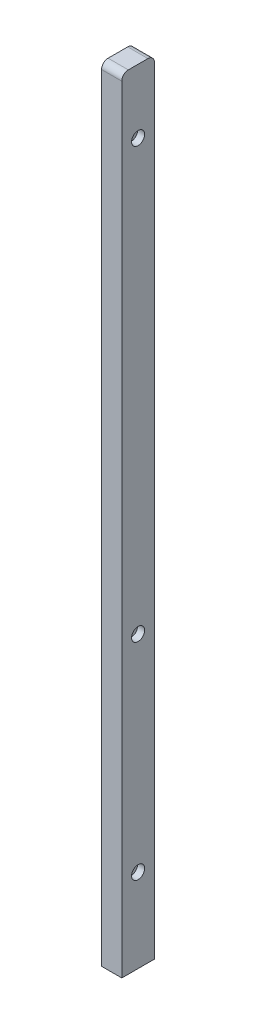
ISO-10303-21;
HEADER;
FILE_DESCRIPTION(('STEP AP214'),'2;1');
FILE_NAME('part.step','',(''),(''),'','','');
FILE_SCHEMA(('AUTOMOTIVE_DESIGN { 1 0 10303 214 1 1 1 1 }'));
ENDSEC;
DATA;
#1=APPLICATION_CONTEXT('core data for automotive mechanical design processes');
#2=APPLICATION_PROTOCOL_DEFINITION('international standard','automotive_design',2000,#1);
#3=PRODUCT_CONTEXT('',#1,'mechanical');
#4=PRODUCT('Part','Part','',(#3));
#5=PRODUCT_RELATED_PRODUCT_CATEGORY('part','',(#4));
#6=PRODUCT_DEFINITION_FORMATION('','',#4);
#7=PRODUCT_DEFINITION_CONTEXT('part definition',#1,'design');
#8=PRODUCT_DEFINITION('design','',#6,#7);
#9=PRODUCT_DEFINITION_SHAPE('','',#8);
#10=(LENGTH_UNIT() NAMED_UNIT(*) SI_UNIT(.MILLI.,.METRE.));
#11=(NAMED_UNIT(*) PLANE_ANGLE_UNIT() SI_UNIT($,.RADIAN.));
#12=(NAMED_UNIT(*) SI_UNIT($,.STERADIAN.) SOLID_ANGLE_UNIT());
#13=UNCERTAINTY_MEASURE_WITH_UNIT(LENGTH_MEASURE(1.E-05),#10,'distance_accuracy_value','');
#14=(GEOMETRIC_REPRESENTATION_CONTEXT(3) GLOBAL_UNCERTAINTY_ASSIGNED_CONTEXT((#13)) GLOBAL_UNIT_ASSIGNED_CONTEXT((#10,
#11,#12)) REPRESENTATION_CONTEXT('',''));
#15=CARTESIAN_POINT('',(0.,0.,0.));
#16=DIRECTION('',(0.,0.,1.));
#17=DIRECTION('',(1.,0.,0.));
#18=AXIS2_PLACEMENT_3D('',#15,#16,#17);
#19=CARTESIAN_POINT('',(7.75,600.,12.5));
#20=DIRECTION('',(-1.,0.,0.));
#21=DIRECTION('',(0.,0.,1.));
#22=AXIS2_PLACEMENT_3D('',#19,#20,#21);
#23=PLANE('',#22);
#24=CARTESIAN_POINT('',(7.75,222.,0.));
#25=DIRECTION('',(1.,0.,0.));
#26=DIRECTION('',(0.,0.,-1.));
#27=AXIS2_PLACEMENT_3D('',#24,#25,#26);
#28=CIRCLE('',#27,5.);
#29=CARTESIAN_POINT('',(7.75,222.,-5.));
#30=VERTEX_POINT('',#29);
#31=EDGE_CURVE('E267',#30,#30,#28,.T.);
#32=ORIENTED_EDGE('',*,*,#31,.F.);
#33=EDGE_LOOP('',(#32));
#34=FACE_BOUND('',#33,.T.);
#35=CARTESIAN_POINT('',(7.75,551.,0.));
#36=DIRECTION('',(1.,0.,0.));
#37=DIRECTION('',(0.,0.,-1.));
#38=AXIS2_PLACEMENT_3D('',#35,#36,#37);
#39=CIRCLE('',#38,5.);
#40=CARTESIAN_POINT('',(7.75,551.,-5.));
#41=VERTEX_POINT('',#40);
#42=EDGE_CURVE('E281',#41,#41,#39,.T.);
#43=ORIENTED_EDGE('',*,*,#42,.F.);
#44=EDGE_LOOP('',(#43));
#45=FACE_BOUND('',#44,.T.);
#46=CARTESIAN_POINT('',(7.75,64.,0.));
#47=DIRECTION('',(1.,0.,0.));
#48=DIRECTION('',(0.,0.,-1.));
#49=AXIS2_PLACEMENT_3D('',#46,#47,#48);
#50=CIRCLE('',#49,5.);
#51=CARTESIAN_POINT('',(7.75,64.,-5.));
#52=VERTEX_POINT('',#51);
#53=EDGE_CURVE('E297',#52,#52,#50,.T.);
#54=ORIENTED_EDGE('',*,*,#53,.F.);
#55=EDGE_LOOP('',(#54));
#56=FACE_BOUND('',#55,.T.);
#57=DIRECTION('',(0.,-1.,0.));
#58=VECTOR('',#57,1.);
#59=CARTESIAN_POINT('',(7.75,600.,-12.5));
#60=LINE('',#59,#58);
#61=CARTESIAN_POINT('',(7.75,595.,-12.5));
#62=VERTEX_POINT('',#61);
#63=CARTESIAN_POINT('',(7.75,0.,-12.5));
#64=VERTEX_POINT('',#63);
#65=EDGE_CURVE('E150',#62,#64,#60,.T.);
#66=ORIENTED_EDGE('',*,*,#65,.F.);
#67=CARTESIAN_POINT('',(7.75,595.,-7.5));
#68=DIRECTION('',(-1.,0.,0.));
#69=DIRECTION('',(0.,0.,1.));
#70=AXIS2_PLACEMENT_3D('',#67,#68,#69);
#71=CIRCLE('',#70,5.);
#72=CARTESIAN_POINT('',(7.75,600.,-7.5));
#73=VERTEX_POINT('',#72);
#74=EDGE_CURVE('E53',#62,#73,#71,.F.);
#75=ORIENTED_EDGE('',*,*,#74,.T.);
#76=DIRECTION('',(0.,0.,-1.));
#77=VECTOR('',#76,1.);
#78=CARTESIAN_POINT('',(7.75,600.,12.5));
#79=LINE('',#78,#77);
#80=CARTESIAN_POINT('',(7.75,600.,7.5));
#81=VERTEX_POINT('',#80);
#82=EDGE_CURVE('E122',#81,#73,#79,.T.);
#83=ORIENTED_EDGE('',*,*,#82,.F.);
#84=CARTESIAN_POINT('',(7.75,595.,7.5));
#85=DIRECTION('',(-1.,0.,0.));
#86=DIRECTION('',(0.,0.,1.));
#87=AXIS2_PLACEMENT_3D('',#84,#85,#86);
#88=CIRCLE('',#87,5.);
#89=CARTESIAN_POINT('',(7.75,595.,12.5));
#90=VERTEX_POINT('',#89);
#91=EDGE_CURVE('E60',#81,#90,#88,.F.);
#92=ORIENTED_EDGE('',*,*,#91,.T.);
#93=DIRECTION('',(0.,-1.,0.));
#94=VECTOR('',#93,1.);
#95=CARTESIAN_POINT('',(7.75,600.,12.5));
#96=LINE('',#95,#94);
#97=CARTESIAN_POINT('',(7.75,0.,12.5));
#98=VERTEX_POINT('',#97);
#99=EDGE_CURVE('E130',#90,#98,#96,.T.);
#100=ORIENTED_EDGE('',*,*,#99,.T.);
#101=DIRECTION('',(0.,0.,-1.));
#102=VECTOR('',#101,1.);
#103=CARTESIAN_POINT('',(7.75,0.,12.5));
#104=LINE('',#103,#102);
#105=EDGE_CURVE('E109',#98,#64,#104,.T.);
#106=ORIENTED_EDGE('',*,*,#105,.T.);
#107=EDGE_LOOP('',(#66,#75,#83,#92,#100,#106));
#108=FACE_BOUND('',#107,.T.);
#109=ADVANCED_FACE('F44',(#34,#45,#56,#108),#23,.F.);
#110=CARTESIAN_POINT('',(-7.75,600.,-12.5));
#111=DIRECTION('',(0.,0.,1.));
#112=DIRECTION('',(1.,0.,0.));
#113=AXIS2_PLACEMENT_3D('',#110,#111,#112);
#114=PLANE('',#113);
#115=DIRECTION('',(0.,-1.,0.));
#116=VECTOR('',#115,1.);
#117=CARTESIAN_POINT('',(-7.75,600.,-12.5));
#118=LINE('',#117,#116);
#119=CARTESIAN_POINT('',(-7.75,595.,-12.5));
#120=VERTEX_POINT('',#119);
#121=CARTESIAN_POINT('',(-7.75,0.,-12.5));
#122=VERTEX_POINT('',#121);
#123=EDGE_CURVE('E147',#120,#122,#118,.T.);
#124=ORIENTED_EDGE('',*,*,#123,.F.);
#125=DIRECTION('',(-1.,0.,0.));
#126=VECTOR('',#125,1.);
#127=CARTESIAN_POINT('',(-7.75,595.,-12.5));
#128=LINE('',#127,#126);
#129=EDGE_CURVE('E68',#120,#62,#128,.F.);
#130=ORIENTED_EDGE('',*,*,#129,.T.);
#131=ORIENTED_EDGE('',*,*,#65,.T.);
#132=DIRECTION('',(-1.,0.,0.));
#133=VECTOR('',#132,1.);
#134=CARTESIAN_POINT('',(-7.75,0.,-12.5));
#135=LINE('',#134,#133);
#136=EDGE_CURVE('E115',#64,#122,#135,.T.);
#137=ORIENTED_EDGE('',*,*,#136,.T.);
#138=EDGE_LOOP('',(#124,#130,#131,#137));
#139=FACE_BOUND('',#138,.T.);
#140=ADVANCED_FACE('F181',(#139),#114,.F.);
#141=CARTESIAN_POINT('',(-7.75,600.,12.5));
#142=DIRECTION('',(1.,0.,0.));
#143=DIRECTION('',(0.,0.,-1.));
#144=AXIS2_PLACEMENT_3D('',#141,#142,#143);
#145=PLANE('',#144);
#146=CARTESIAN_POINT('',(-7.75,222.,0.));
#147=DIRECTION('',(1.,0.,0.));
#148=DIRECTION('',(0.,0.,-1.));
#149=AXIS2_PLACEMENT_3D('',#146,#147,#148);
#150=CIRCLE('',#149,2.75);
#151=CARTESIAN_POINT('',(-7.75,222.,-2.75));
#152=VERTEX_POINT('',#151);
#153=EDGE_CURVE('E277',#152,#152,#150,.T.);
#154=ORIENTED_EDGE('',*,*,#153,.T.);
#155=EDGE_LOOP('',(#154));
#156=FACE_BOUND('',#155,.T.);
#157=CARTESIAN_POINT('',(-7.75,551.,0.));
#158=DIRECTION('',(1.,0.,0.));
#159=DIRECTION('',(0.,0.,-1.));
#160=AXIS2_PLACEMENT_3D('',#157,#158,#159);
#161=CIRCLE('',#160,2.75000000000003);
#162=CARTESIAN_POINT('',(-7.75,551.,-2.75000000000003));
#163=VERTEX_POINT('',#162);
#164=EDGE_CURVE('E293',#163,#163,#161,.T.);
#165=ORIENTED_EDGE('',*,*,#164,.T.);
#166=EDGE_LOOP('',(#165));
#167=FACE_BOUND('',#166,.T.);
#168=CARTESIAN_POINT('',(-7.75,64.,0.));
#169=DIRECTION('',(1.,0.,0.));
#170=DIRECTION('',(0.,0.,-1.));
#171=AXIS2_PLACEMENT_3D('',#168,#169,#170);
#172=CIRCLE('',#171,2.75);
#173=CARTESIAN_POINT('',(-7.75,64.,-2.75));
#174=VERTEX_POINT('',#173);
#175=EDGE_CURVE('E118',#174,#174,#172,.T.);
#176=ORIENTED_EDGE('',*,*,#175,.T.);
#177=EDGE_LOOP('',(#176));
#178=FACE_BOUND('',#177,.T.);
#179=DIRECTION('',(0.,0.,1.));
#180=VECTOR('',#179,1.);
#181=CARTESIAN_POINT('',(-7.75,600.,12.5));
#182=LINE('',#181,#180);
#183=CARTESIAN_POINT('',(-7.75,600.,-7.5));
#184=VERTEX_POINT('',#183);
#185=CARTESIAN_POINT('',(-7.75,600.,7.5));
#186=VERTEX_POINT('',#185);
#187=EDGE_CURVE('E126',#184,#186,#182,.T.);
#188=ORIENTED_EDGE('',*,*,#187,.F.);
#189=CARTESIAN_POINT('',(-7.75,595.,-7.5));
#190=DIRECTION('',(1.,0.,0.));
#191=DIRECTION('',(0.,0.,-1.));
#192=AXIS2_PLACEMENT_3D('',#189,#190,#191);
#193=CIRCLE('',#192,5.);
#194=EDGE_CURVE('E164',#184,#120,#193,.F.);
#195=ORIENTED_EDGE('',*,*,#194,.T.);
#196=ORIENTED_EDGE('',*,*,#123,.T.);
#197=DIRECTION('',(0.,0.,1.));
#198=VECTOR('',#197,1.);
#199=CARTESIAN_POINT('',(-7.75,0.,12.5));
#200=LINE('',#199,#198);
#201=CARTESIAN_POINT('',(-7.75,0.,12.5));
#202=VERTEX_POINT('',#201);
#203=EDGE_CURVE('E135',#122,#202,#200,.T.);
#204=ORIENTED_EDGE('',*,*,#203,.T.);
#205=DIRECTION('',(0.,-1.,0.));
#206=VECTOR('',#205,1.);
#207=CARTESIAN_POINT('',(-7.75,600.,12.5));
#208=LINE('',#207,#206);
#209=CARTESIAN_POINT('',(-7.75,595.,12.5));
#210=VERTEX_POINT('',#209);
#211=EDGE_CURVE('E144',#210,#202,#208,.T.);
#212=ORIENTED_EDGE('',*,*,#211,.F.);
#213=CARTESIAN_POINT('',(-7.75,595.,7.5));
#214=DIRECTION('',(1.,0.,0.));
#215=DIRECTION('',(0.,0.,-1.));
#216=AXIS2_PLACEMENT_3D('',#213,#214,#215);
#217=CIRCLE('',#216,5.);
#218=EDGE_CURVE('E161',#210,#186,#217,.F.);
#219=ORIENTED_EDGE('',*,*,#218,.T.);
#220=EDGE_LOOP('',(#188,#195,#196,#204,#212,#219));
#221=FACE_BOUND('',#220,.T.);
#222=ADVANCED_FACE('F180',(#156,#167,#178,#221),#145,.F.);
#223=CARTESIAN_POINT('',(-7.75,600.,12.5));
#224=DIRECTION('',(0.,0.,-1.));
#225=DIRECTION('',(-1.,0.,0.));
#226=AXIS2_PLACEMENT_3D('',#223,#224,#225);
#227=PLANE('',#226);
#228=ORIENTED_EDGE('',*,*,#99,.F.);
#229=DIRECTION('',(1.,0.,0.));
#230=VECTOR('',#229,1.);
#231=CARTESIAN_POINT('',(-7.75,595.,12.5));
#232=LINE('',#231,#230);
#233=EDGE_CURVE('E11',#90,#210,#232,.F.);
#234=ORIENTED_EDGE('',*,*,#233,.T.);
#235=ORIENTED_EDGE('',*,*,#211,.T.);
#236=DIRECTION('',(1.,0.,0.));
#237=VECTOR('',#236,1.);
#238=CARTESIAN_POINT('',(-7.75,0.,12.5));
#239=LINE('',#238,#237);
#240=EDGE_CURVE('E127',#202,#98,#239,.T.);
#241=ORIENTED_EDGE('',*,*,#240,.T.);
#242=EDGE_LOOP('',(#228,#234,#235,#241));
#243=FACE_BOUND('',#242,.T.);
#244=ADVANCED_FACE('F193',(#243),#227,.F.);
#245=CARTESIAN_POINT('',(0.,600.,0.));
#246=DIRECTION('',(0.,-1.,0.));
#247=DIRECTION('',(0.,0.,-1.));
#248=AXIS2_PLACEMENT_3D('',#245,#246,#247);
#249=PLANE('',#248);
#250=ORIENTED_EDGE('',*,*,#82,.T.);
#251=DIRECTION('',(-1.,0.,0.));
#252=VECTOR('',#251,1.);
#253=CARTESIAN_POINT('',(0.,600.,-7.5));
#254=LINE('',#253,#252);
#255=EDGE_CURVE('E157',#73,#184,#254,.T.);
#256=ORIENTED_EDGE('',*,*,#255,.T.);
#257=ORIENTED_EDGE('',*,*,#187,.T.);
#258=DIRECTION('',(1.,0.,0.));
#259=VECTOR('',#258,1.);
#260=CARTESIAN_POINT('',(0.,600.,7.5));
#261=LINE('',#260,#259);
#262=EDGE_CURVE('E153',#186,#81,#261,.T.);
#263=ORIENTED_EDGE('',*,*,#262,.T.);
#264=EDGE_LOOP('',(#250,#256,#257,#263));
#265=FACE_BOUND('',#264,.T.);
#266=ADVANCED_FACE('F175',(#265),#249,.F.);
#267=CARTESIAN_POINT('',(0.,0.,0.));
#268=DIRECTION('',(0.,-1.,0.));
#269=DIRECTION('',(0.,0.,-1.));
#270=AXIS2_PLACEMENT_3D('',#267,#268,#269);
#271=PLANE('',#270);
#272=CARTESIAN_POINT('',(0.,0.,0.));
#273=DIRECTION('',(0.,-1.,0.));
#274=DIRECTION('',(0.,0.,-1.));
#275=AXIS2_PLACEMENT_3D('',#272,#273,#274);
#276=CIRCLE('',#275,3.3);
#277=CARTESIAN_POINT('',(0.,0.,-3.3));
#278=VERTEX_POINT('',#277);
#279=EDGE_CURVE('E110',#278,#278,#276,.T.);
#280=ORIENTED_EDGE('',*,*,#279,.F.);
#281=EDGE_LOOP('',(#280));
#282=FACE_BOUND('',#281,.T.);
#283=ORIENTED_EDGE('',*,*,#105,.F.);
#284=ORIENTED_EDGE('',*,*,#240,.F.);
#285=ORIENTED_EDGE('',*,*,#203,.F.);
#286=ORIENTED_EDGE('',*,*,#136,.F.);
#287=EDGE_LOOP('',(#283,#284,#285,#286));
#288=FACE_BOUND('',#287,.T.);
#289=ADVANCED_FACE('F187',(#282,#288),#271,.T.);
#290=CARTESIAN_POINT('',(0.,595.,-7.5));
#291=DIRECTION('',(-1.,0.,0.));
#292=DIRECTION('',(0.,0.,1.));
#293=AXIS2_PLACEMENT_3D('',#290,#291,#292);
#294=CYLINDRICAL_SURFACE('',#293,5.);
#295=ORIENTED_EDGE('',*,*,#74,.F.);
#296=ORIENTED_EDGE('',*,*,#129,.F.);
#297=ORIENTED_EDGE('',*,*,#194,.F.);
#298=ORIENTED_EDGE('',*,*,#255,.F.);
#299=EDGE_LOOP('',(#295,#296,#297,#298));
#300=FACE_BOUND('',#299,.T.);
#301=ADVANCED_FACE('F178',(#300),#294,.T.);
#302=CARTESIAN_POINT('',(0.,595.,7.5));
#303=DIRECTION('',(1.,0.,0.));
#304=DIRECTION('',(0.,0.,-1.));
#305=AXIS2_PLACEMENT_3D('',#302,#303,#304);
#306=CYLINDRICAL_SURFACE('',#305,5.);
#307=ORIENTED_EDGE('',*,*,#218,.F.);
#308=ORIENTED_EDGE('',*,*,#233,.F.);
#309=ORIENTED_EDGE('',*,*,#91,.F.);
#310=ORIENTED_EDGE('',*,*,#262,.F.);
#311=EDGE_LOOP('',(#307,#308,#309,#310));
#312=FACE_BOUND('',#311,.T.);
#313=ADVANCED_FACE('F46',(#312),#306,.T.);
#314=CARTESIAN_POINT('',(0.,12.,0.));
#315=DIRECTION('',(0.,-1.,0.));
#316=DIRECTION('',(0.,0.,-1.));
#317=AXIS2_PLACEMENT_3D('',#314,#315,#316);
#318=CONICAL_SURFACE('',#317,3.3,1.02974425867665);
#319=CARTESIAN_POINT('',(0.,13.9828400427909,0.));
#320=VERTEX_POINT('',#319);
#321=VERTEX_LOOP('',#320);
#322=FACE_BOUND('',#321,.T.);
#323=CARTESIAN_POINT('',(0.,12.,0.));
#324=DIRECTION('',(0.,-1.,0.));
#325=DIRECTION('',(0.,0.,-1.));
#326=AXIS2_PLACEMENT_3D('',#323,#324,#325);
#327=CIRCLE('',#326,3.3);
#328=CARTESIAN_POINT('',(0.,12.,-3.3));
#329=VERTEX_POINT('',#328);
#330=EDGE_CURVE('E106',#329,#329,#327,.T.);
#331=ORIENTED_EDGE('',*,*,#330,.T.);
#332=EDGE_LOOP('',(#331));
#333=FACE_BOUND('',#332,.T.);
#334=ADVANCED_FACE('F99',(#322,#333),#318,.F.);
#335=CARTESIAN_POINT('',(0.,0.,0.));
#336=DIRECTION('',(0.,-1.,0.));
#337=DIRECTION('',(0.,0.,-1.));
#338=AXIS2_PLACEMENT_3D('',#335,#336,#337);
#339=CYLINDRICAL_SURFACE('',#338,3.3);
#340=ORIENTED_EDGE('',*,*,#330,.F.);
#341=EDGE_LOOP('',(#340));
#342=FACE_BOUND('',#341,.T.);
#343=ORIENTED_EDGE('',*,*,#279,.T.);
#344=EDGE_LOOP('',(#343));
#345=FACE_BOUND('',#344,.T.);
#346=ADVANCED_FACE('F102',(#342,#345),#339,.F.);
#347=CARTESIAN_POINT('',(7.75,64.,0.));
#348=DIRECTION('',(1.,0.,0.));
#349=DIRECTION('',(0.,0.,-1.));
#350=AXIS2_PLACEMENT_3D('',#347,#348,#349);
#351=CYLINDRICAL_SURFACE('',#350,2.75);
#352=ORIENTED_EDGE('',*,*,#175,.F.);
#353=EDGE_LOOP('',(#352));
#354=FACE_BOUND('',#353,.T.);
#355=CARTESIAN_POINT('',(2.35,64.,0.));
#356=DIRECTION('',(1.,0.,0.));
#357=DIRECTION('',(0.,0.,-1.));
#358=AXIS2_PLACEMENT_3D('',#355,#356,#357);
#359=CIRCLE('',#358,2.75);
#360=CARTESIAN_POINT('',(2.35,64.,-2.75));
#361=VERTEX_POINT('',#360);
#362=EDGE_CURVE('E305',#361,#361,#359,.T.);
#363=ORIENTED_EDGE('',*,*,#362,.T.);
#364=EDGE_LOOP('',(#363));
#365=FACE_BOUND('',#364,.T.);
#366=ADVANCED_FACE('F225',(#354,#365),#351,.F.);
#367=CARTESIAN_POINT('',(2.35,66.75,0.));
#368=DIRECTION('',(-1.,0.,0.));
#369=DIRECTION('',(0.,0.,1.));
#370=AXIS2_PLACEMENT_3D('',#367,#368,#369);
#371=PLANE('',#370);
#372=ORIENTED_EDGE('',*,*,#362,.F.);
#373=EDGE_LOOP('',(#372));
#374=FACE_BOUND('',#373,.T.);
#375=CARTESIAN_POINT('',(2.35,64.,0.));
#376=DIRECTION('',(1.,0.,0.));
#377=DIRECTION('',(0.,0.,-1.));
#378=AXIS2_PLACEMENT_3D('',#375,#376,#377);
#379=CIRCLE('',#378,5.);
#380=CARTESIAN_POINT('',(2.35,64.,-5.));
#381=VERTEX_POINT('',#380);
#382=EDGE_CURVE('E301',#381,#381,#379,.T.);
#383=ORIENTED_EDGE('',*,*,#382,.T.);
#384=EDGE_LOOP('',(#383));
#385=FACE_BOUND('',#384,.T.);
#386=ADVANCED_FACE('F228',(#374,#385),#371,.F.);
#387=CARTESIAN_POINT('',(7.75,64.,0.));
#388=DIRECTION('',(1.,0.,0.));
#389=DIRECTION('',(0.,0.,-1.));
#390=AXIS2_PLACEMENT_3D('',#387,#388,#389);
#391=CYLINDRICAL_SURFACE('',#390,5.);
#392=ORIENTED_EDGE('',*,*,#382,.F.);
#393=EDGE_LOOP('',(#392));
#394=FACE_BOUND('',#393,.T.);
#395=ORIENTED_EDGE('',*,*,#53,.T.);
#396=EDGE_LOOP('',(#395));
#397=FACE_BOUND('',#396,.T.);
#398=ADVANCED_FACE('F232',(#394,#397),#391,.F.);
#399=CARTESIAN_POINT('',(7.75,551.,0.));
#400=DIRECTION('',(1.,0.,0.));
#401=DIRECTION('',(0.,0.,-1.));
#402=AXIS2_PLACEMENT_3D('',#399,#400,#401);
#403=CYLINDRICAL_SURFACE('',#402,2.75000000000003);
#404=ORIENTED_EDGE('',*,*,#164,.F.);
#405=EDGE_LOOP('',(#404));
#406=FACE_BOUND('',#405,.T.);
#407=CARTESIAN_POINT('',(2.35,551.,0.));
#408=DIRECTION('',(1.,0.,0.));
#409=DIRECTION('',(0.,0.,-1.));
#410=AXIS2_PLACEMENT_3D('',#407,#408,#409);
#411=CIRCLE('',#410,2.75000000000003);
#412=CARTESIAN_POINT('',(2.35,551.,-2.75000000000003));
#413=VERTEX_POINT('',#412);
#414=EDGE_CURVE('E289',#413,#413,#411,.T.);
#415=ORIENTED_EDGE('',*,*,#414,.T.);
#416=EDGE_LOOP('',(#415));
#417=FACE_BOUND('',#416,.T.);
#418=ADVANCED_FACE('F236',(#406,#417),#403,.F.);
#419=CARTESIAN_POINT('',(2.35,553.75,0.));
#420=DIRECTION('',(-1.,0.,0.));
#421=DIRECTION('',(0.,0.,1.));
#422=AXIS2_PLACEMENT_3D('',#419,#420,#421);
#423=PLANE('',#422);
#424=ORIENTED_EDGE('',*,*,#414,.F.);
#425=EDGE_LOOP('',(#424));
#426=FACE_BOUND('',#425,.T.);
#427=CARTESIAN_POINT('',(2.35,551.,0.));
#428=DIRECTION('',(1.,0.,0.));
#429=DIRECTION('',(0.,0.,-1.));
#430=AXIS2_PLACEMENT_3D('',#427,#428,#429);
#431=CIRCLE('',#430,5.);
#432=CARTESIAN_POINT('',(2.35,551.,-5.));
#433=VERTEX_POINT('',#432);
#434=EDGE_CURVE('E285',#433,#433,#431,.T.);
#435=ORIENTED_EDGE('',*,*,#434,.T.);
#436=EDGE_LOOP('',(#435));
#437=FACE_BOUND('',#436,.T.);
#438=ADVANCED_FACE('F240',(#426,#437),#423,.F.);
#439=CARTESIAN_POINT('',(7.75,551.,0.));
#440=DIRECTION('',(1.,0.,0.));
#441=DIRECTION('',(0.,0.,-1.));
#442=AXIS2_PLACEMENT_3D('',#439,#440,#441);
#443=CYLINDRICAL_SURFACE('',#442,5.);
#444=ORIENTED_EDGE('',*,*,#434,.F.);
#445=EDGE_LOOP('',(#444));
#446=FACE_BOUND('',#445,.T.);
#447=ORIENTED_EDGE('',*,*,#42,.T.);
#448=EDGE_LOOP('',(#447));
#449=FACE_BOUND('',#448,.T.);
#450=ADVANCED_FACE('F244',(#446,#449),#443,.F.);
#451=CARTESIAN_POINT('',(7.75,222.,0.));
#452=DIRECTION('',(1.,0.,0.));
#453=DIRECTION('',(0.,0.,-1.));
#454=AXIS2_PLACEMENT_3D('',#451,#452,#453);
#455=CYLINDRICAL_SURFACE('',#454,2.75);
#456=ORIENTED_EDGE('',*,*,#153,.F.);
#457=EDGE_LOOP('',(#456));
#458=FACE_BOUND('',#457,.T.);
#459=CARTESIAN_POINT('',(2.35,222.,0.));
#460=DIRECTION('',(1.,0.,0.));
#461=DIRECTION('',(0.,0.,-1.));
#462=AXIS2_PLACEMENT_3D('',#459,#460,#461);
#463=CIRCLE('',#462,2.75);
#464=CARTESIAN_POINT('',(2.35,222.,-2.75));
#465=VERTEX_POINT('',#464);
#466=EDGE_CURVE('E271',#465,#465,#463,.T.);
#467=ORIENTED_EDGE('',*,*,#466,.T.);
#468=EDGE_LOOP('',(#467));
#469=FACE_BOUND('',#468,.T.);
#470=ADVANCED_FACE('F248',(#458,#469),#455,.F.);
#471=CARTESIAN_POINT('',(2.35,224.75,0.));
#472=DIRECTION('',(-1.,0.,0.));
#473=DIRECTION('',(0.,0.,1.));
#474=AXIS2_PLACEMENT_3D('',#471,#472,#473);
#475=PLANE('',#474);
#476=ORIENTED_EDGE('',*,*,#466,.F.);
#477=EDGE_LOOP('',(#476));
#478=FACE_BOUND('',#477,.T.);
#479=CARTESIAN_POINT('',(2.35,222.,0.));
#480=DIRECTION('',(1.,0.,0.));
#481=DIRECTION('',(0.,0.,-1.));
#482=AXIS2_PLACEMENT_3D('',#479,#480,#481);
#483=CIRCLE('',#482,5.);
#484=CARTESIAN_POINT('',(2.35,222.,-5.));
#485=VERTEX_POINT('',#484);
#486=EDGE_CURVE('E265',#485,#485,#483,.T.);
#487=ORIENTED_EDGE('',*,*,#486,.T.);
#488=EDGE_LOOP('',(#487));
#489=FACE_BOUND('',#488,.T.);
#490=ADVANCED_FACE('F252',(#478,#489),#475,.F.);
#491=CARTESIAN_POINT('',(7.75,222.,0.));
#492=DIRECTION('',(1.,0.,0.));
#493=DIRECTION('',(0.,0.,-1.));
#494=AXIS2_PLACEMENT_3D('',#491,#492,#493);
#495=CYLINDRICAL_SURFACE('',#494,5.);
#496=ORIENTED_EDGE('',*,*,#486,.F.);
#497=EDGE_LOOP('',(#496));
#498=FACE_BOUND('',#497,.T.);
#499=ORIENTED_EDGE('',*,*,#31,.T.);
#500=EDGE_LOOP('',(#499));
#501=FACE_BOUND('',#500,.T.);
#502=ADVANCED_FACE('F256',(#498,#501),#495,.F.);
#503=CLOSED_SHELL('',(#109,#140,#222,#244,#266,#289,#301,#313,#334,#346,#366,#386,#398,#418,
#438,#450,#470,#490,#502));
#504=MANIFOLD_SOLID_BREP('B2',#503);
#505=ADVANCED_BREP_SHAPE_REPRESENTATION('',(#18,#504),#14);
#506=SHAPE_DEFINITION_REPRESENTATION(#9,#505);
ENDSEC;
END-ISO-10303-21;
